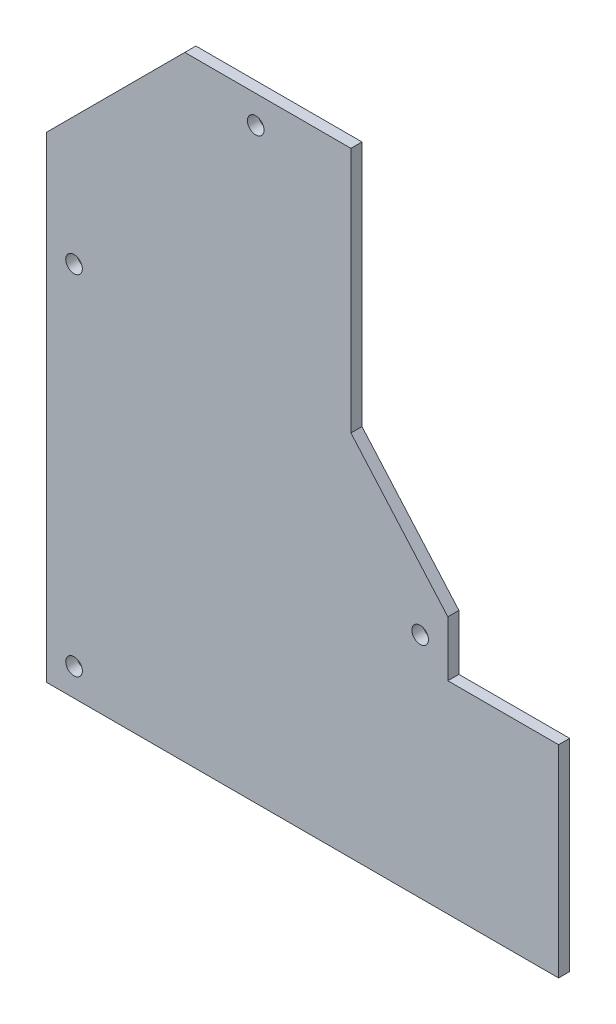
ISO-10303-21;
HEADER;
FILE_DESCRIPTION(('STEP AP214'),'2;1');
FILE_NAME('part.step','',(''),(''),'','','');
FILE_SCHEMA(('AUTOMOTIVE_DESIGN { 1 0 10303 214 1 1 1 1 }'));
ENDSEC;
DATA;
#1=APPLICATION_CONTEXT('core data for automotive mechanical design processes');
#2=APPLICATION_PROTOCOL_DEFINITION('international standard','automotive_design',2000,#1);
#3=PRODUCT_CONTEXT('',#1,'mechanical');
#4=PRODUCT('Part','Part','',(#3));
#5=PRODUCT_RELATED_PRODUCT_CATEGORY('part','',(#4));
#6=PRODUCT_DEFINITION_FORMATION('','',#4);
#7=PRODUCT_DEFINITION_CONTEXT('part definition',#1,'design');
#8=PRODUCT_DEFINITION('design','',#6,#7);
#9=PRODUCT_DEFINITION_SHAPE('','',#8);
#10=(LENGTH_UNIT() NAMED_UNIT(*) SI_UNIT(.MILLI.,.METRE.));
#11=(NAMED_UNIT(*) PLANE_ANGLE_UNIT() SI_UNIT($,.RADIAN.));
#12=(NAMED_UNIT(*) SI_UNIT($,.STERADIAN.) SOLID_ANGLE_UNIT());
#13=UNCERTAINTY_MEASURE_WITH_UNIT(LENGTH_MEASURE(1.E-05),#10,'distance_accuracy_value','');
#14=(GEOMETRIC_REPRESENTATION_CONTEXT(3) GLOBAL_UNCERTAINTY_ASSIGNED_CONTEXT((#13)) GLOBAL_UNIT_ASSIGNED_CONTEXT((#10,
#11,#12)) REPRESENTATION_CONTEXT('',''));
#15=CARTESIAN_POINT('',(0.,0.,0.));
#16=DIRECTION('',(0.,0.,1.));
#17=DIRECTION('',(1.,0.,0.));
#18=AXIS2_PLACEMENT_3D('',#15,#16,#17);
#19=CARTESIAN_POINT('',(-84.9999999999999,97.0000000000001,4.));
#20=DIRECTION('',(1.,0.,0.));
#21=DIRECTION('',(0.,1.,0.));
#22=AXIS2_PLACEMENT_3D('',#19,#20,#21);
#23=PLANE('',#22);
#24=DIRECTION('',(0.,-1.,0.));
#25=VECTOR('',#24,1.);
#26=CARTESIAN_POINT('',(-84.9999999999999,97.0000000000001,0.));
#27=LINE('',#26,#25);
#28=CARTESIAN_POINT('',(-84.9999999999999,97.0000000000001,0.));
#29=VERTEX_POINT('',#28);
#30=CARTESIAN_POINT('',(-84.9999999999999,-74.9999999999997,0.));
#31=VERTEX_POINT('',#30);
#32=EDGE_CURVE('E134',#29,#31,#27,.T.);
#33=ORIENTED_EDGE('',*,*,#32,.T.);
#34=DIRECTION('',(0.,0.,-1.));
#35=VECTOR('',#34,1.);
#36=CARTESIAN_POINT('',(-84.9999999999999,-74.9999999999997,4.));
#37=LINE('',#36,#35);
#38=CARTESIAN_POINT('',(-84.9999999999999,-74.9999999999997,4.));
#39=VERTEX_POINT('',#38);
#40=EDGE_CURVE('E11',#39,#31,#37,.T.);
#41=ORIENTED_EDGE('',*,*,#40,.F.);
#42=DIRECTION('',(0.,-1.,0.));
#43=VECTOR('',#42,1.);
#44=CARTESIAN_POINT('',(-84.9999999999999,97.0000000000001,4.));
#45=LINE('',#44,#43);
#46=CARTESIAN_POINT('',(-84.9999999999999,97.0000000000001,4.));
#47=VERTEX_POINT('',#46);
#48=EDGE_CURVE('E151',#47,#39,#45,.T.);
#49=ORIENTED_EDGE('',*,*,#48,.F.);
#50=DIRECTION('',(0.,0.,-1.));
#51=VECTOR('',#50,1.);
#52=CARTESIAN_POINT('',(-84.9999999999999,97.0000000000001,4.));
#53=LINE('',#52,#51);
#54=EDGE_CURVE('E130',#47,#29,#53,.T.);
#55=ORIENTED_EDGE('',*,*,#54,.T.);
#56=EDGE_LOOP('',(#33,#41,#49,#55));
#57=FACE_BOUND('',#56,.T.);
#58=ADVANCED_FACE('F32',(#57),#23,.F.);
#59=CARTESIAN_POINT('',(-84.9999999999999,-74.9999999999997,4.));
#60=DIRECTION('',(0.,1.,0.));
#61=DIRECTION('',(0.,0.,1.));
#62=AXIS2_PLACEMENT_3D('',#59,#60,#61);
#63=PLANE('',#62);
#64=DIRECTION('',(1.,0.,0.));
#65=VECTOR('',#64,1.);
#66=CARTESIAN_POINT('',(-84.9999999999999,-74.9999999999997,0.));
#67=LINE('',#66,#65);
#68=CARTESIAN_POINT('',(100.,-74.9999999999997,0.));
#69=VERTEX_POINT('',#68);
#70=EDGE_CURVE('E137',#31,#69,#67,.T.);
#71=ORIENTED_EDGE('',*,*,#70,.T.);
#72=DIRECTION('',(0.,0.,-1.));
#73=VECTOR('',#72,1.);
#74=CARTESIAN_POINT('',(100.,-74.9999999999997,4.));
#75=LINE('',#74,#73);
#76=CARTESIAN_POINT('',(100.,-74.9999999999997,4.));
#77=VERTEX_POINT('',#76);
#78=EDGE_CURVE('E40',#77,#69,#75,.T.);
#79=ORIENTED_EDGE('',*,*,#78,.F.);
#80=DIRECTION('',(1.,0.,0.));
#81=VECTOR('',#80,1.);
#82=CARTESIAN_POINT('',(-84.9999999999999,-74.9999999999997,4.));
#83=LINE('',#82,#81);
#84=EDGE_CURVE('E94',#39,#77,#83,.T.);
#85=ORIENTED_EDGE('',*,*,#84,.F.);
#86=ORIENTED_EDGE('',*,*,#40,.T.);
#87=EDGE_LOOP('',(#71,#79,#85,#86));
#88=FACE_BOUND('',#87,.T.);
#89=ADVANCED_FACE('F240',(#88),#63,.F.);
#90=CARTESIAN_POINT('',(100.,-74.9999999999997,4.));
#91=DIRECTION('',(-1.,0.,0.));
#92=DIRECTION('',(0.,0.,1.));
#93=AXIS2_PLACEMENT_3D('',#90,#91,#92);
#94=PLANE('',#93);
#95=DIRECTION('',(0.,1.,0.));
#96=VECTOR('',#95,1.);
#97=CARTESIAN_POINT('',(100.,-74.9999999999997,0.));
#98=LINE('',#97,#96);
#99=CARTESIAN_POINT('',(100.,-2.03181579102166,0.));
#100=VERTEX_POINT('',#99);
#101=EDGE_CURVE('E140',#69,#100,#98,.T.);
#102=ORIENTED_EDGE('',*,*,#101,.T.);
#103=DIRECTION('',(0.,0.,-1.));
#104=VECTOR('',#103,1.);
#105=CARTESIAN_POINT('',(100.,-2.03181579102166,4.));
#106=LINE('',#105,#104);
#107=CARTESIAN_POINT('',(100.,-2.03181579102166,4.));
#108=VERTEX_POINT('',#107);
#109=EDGE_CURVE('E161',#108,#100,#106,.T.);
#110=ORIENTED_EDGE('',*,*,#109,.F.);
#111=DIRECTION('',(0.,1.,0.));
#112=VECTOR('',#111,1.);
#113=CARTESIAN_POINT('',(100.,-74.9999999999997,4.));
#114=LINE('',#113,#112);
#115=EDGE_CURVE('E169',#77,#108,#114,.T.);
#116=ORIENTED_EDGE('',*,*,#115,.F.);
#117=ORIENTED_EDGE('',*,*,#78,.T.);
#118=EDGE_LOOP('',(#102,#110,#116,#117));
#119=FACE_BOUND('',#118,.T.);
#120=ADVANCED_FACE('F167',(#119),#94,.F.);
#121=CARTESIAN_POINT('',(100.,-2.03181579102166,4.));
#122=DIRECTION('',(0.,-1.,0.));
#123=DIRECTION('',(1.,0.,0.));
#124=AXIS2_PLACEMENT_3D('',#121,#122,#123);
#125=PLANE('',#124);
#126=DIRECTION('',(-1.,0.,0.));
#127=VECTOR('',#126,1.);
#128=CARTESIAN_POINT('',(100.,-2.03181579102166,0.));
#129=LINE('',#128,#127);
#130=CARTESIAN_POINT('',(60.,-2.03181579102167,0.));
#131=VERTEX_POINT('',#130);
#132=EDGE_CURVE('E142',#100,#131,#129,.T.);
#133=ORIENTED_EDGE('',*,*,#132,.T.);
#134=DIRECTION('',(0.,0.,-1.));
#135=VECTOR('',#134,1.);
#136=CARTESIAN_POINT('',(60.,-2.03181579102167,4.));
#137=LINE('',#136,#135);
#138=CARTESIAN_POINT('',(60.,-2.03181579102167,4.));
#139=VERTEX_POINT('',#138);
#140=EDGE_CURVE('E158',#139,#131,#137,.T.);
#141=ORIENTED_EDGE('',*,*,#140,.F.);
#142=DIRECTION('',(-1.,0.,0.));
#143=VECTOR('',#142,1.);
#144=CARTESIAN_POINT('',(100.,-2.03181579102166,4.));
#145=LINE('',#144,#143);
#146=EDGE_CURVE('E185',#108,#139,#145,.T.);
#147=ORIENTED_EDGE('',*,*,#146,.F.);
#148=ORIENTED_EDGE('',*,*,#109,.T.);
#149=EDGE_LOOP('',(#133,#141,#147,#148));
#150=FACE_BOUND('',#149,.T.);
#151=ADVANCED_FACE('F178',(#150),#125,.F.);
#152=CARTESIAN_POINT('',(60.,-2.03181579102167,4.));
#153=DIRECTION('',(-1.,0.,0.));
#154=DIRECTION('',(0.,0.,1.));
#155=AXIS2_PLACEMENT_3D('',#152,#153,#154);
#156=PLANE('',#155);
#157=DIRECTION('',(0.,1.,0.));
#158=VECTOR('',#157,1.);
#159=CARTESIAN_POINT('',(60.,-2.03181579102167,0.));
#160=LINE('',#159,#158);
#161=CARTESIAN_POINT('',(60.,17.9681842089783,0.));
#162=VERTEX_POINT('',#161);
#163=EDGE_CURVE('E144',#131,#162,#160,.T.);
#164=ORIENTED_EDGE('',*,*,#163,.T.);
#165=DIRECTION('',(0.,0.,-1.));
#166=VECTOR('',#165,1.);
#167=CARTESIAN_POINT('',(60.,17.9681842089783,4.));
#168=LINE('',#167,#166);
#169=CARTESIAN_POINT('',(60.,17.9681842089783,4.));
#170=VERTEX_POINT('',#169);
#171=EDGE_CURVE('E155',#170,#162,#168,.T.);
#172=ORIENTED_EDGE('',*,*,#171,.F.);
#173=DIRECTION('',(0.,1.,0.));
#174=VECTOR('',#173,1.);
#175=CARTESIAN_POINT('',(60.,-2.03181579102167,4.));
#176=LINE('',#175,#174);
#177=EDGE_CURVE('E184',#139,#170,#176,.T.);
#178=ORIENTED_EDGE('',*,*,#177,.F.);
#179=ORIENTED_EDGE('',*,*,#140,.T.);
#180=EDGE_LOOP('',(#164,#172,#178,#179));
#181=FACE_BOUND('',#180,.T.);
#182=ADVANCED_FACE('F182',(#181),#156,.F.);
#183=CARTESIAN_POINT('',(60.,17.9681842089783,4.));
#184=DIRECTION('',(-0.752576694706878,-0.658504607868518,0.));
#185=DIRECTION('',(0.658504607868518,-0.752576694706878,0.));
#186=AXIS2_PLACEMENT_3D('',#183,#184,#185);
#187=PLANE('',#186);
#188=DIRECTION('',(-0.658504607868518,0.752576694706878,0.));
#189=VECTOR('',#188,1.);
#190=CARTESIAN_POINT('',(60.,17.9681842089783,0.));
#191=LINE('',#190,#189);
#192=CARTESIAN_POINT('',(25.,57.9681842089783,0.));
#193=VERTEX_POINT('',#192);
#194=EDGE_CURVE('E146',#162,#193,#191,.T.);
#195=ORIENTED_EDGE('',*,*,#194,.T.);
#196=DIRECTION('',(0.,0.,-1.));
#197=VECTOR('',#196,1.);
#198=CARTESIAN_POINT('',(25.,57.9681842089783,4.));
#199=LINE('',#198,#197);
#200=CARTESIAN_POINT('',(25.,57.9681842089783,4.));
#201=VERTEX_POINT('',#200);
#202=EDGE_CURVE('E125',#201,#193,#199,.T.);
#203=ORIENTED_EDGE('',*,*,#202,.F.);
#204=DIRECTION('',(-0.658504607868518,0.752576694706878,0.));
#205=VECTOR('',#204,1.);
#206=CARTESIAN_POINT('',(60.,17.9681842089783,4.));
#207=LINE('',#206,#205);
#208=EDGE_CURVE('E116',#170,#201,#207,.T.);
#209=ORIENTED_EDGE('',*,*,#208,.F.);
#210=ORIENTED_EDGE('',*,*,#171,.T.);
#211=EDGE_LOOP('',(#195,#203,#209,#210));
#212=FACE_BOUND('',#211,.T.);
#213=ADVANCED_FACE('F248',(#212),#187,.F.);
#214=CARTESIAN_POINT('',(25.,57.9681842089783,4.));
#215=DIRECTION('',(-1.,0.,0.));
#216=DIRECTION('',(0.,0.,1.));
#217=AXIS2_PLACEMENT_3D('',#214,#215,#216);
#218=PLANE('',#217);
#219=DIRECTION('',(0.,1.,0.));
#220=VECTOR('',#219,1.);
#221=CARTESIAN_POINT('',(25.,57.9681842089783,0.));
#222=LINE('',#221,#220);
#223=CARTESIAN_POINT('',(25.,147.,0.));
#224=VERTEX_POINT('',#223);
#225=EDGE_CURVE('E124',#193,#224,#222,.T.);
#226=ORIENTED_EDGE('',*,*,#225,.T.);
#227=DIRECTION('',(0.,0.,-1.));
#228=VECTOR('',#227,1.);
#229=CARTESIAN_POINT('',(25.,147.,4.));
#230=LINE('',#229,#228);
#231=CARTESIAN_POINT('',(25.,147.,4.));
#232=VERTEX_POINT('',#231);
#233=EDGE_CURVE('E121',#232,#224,#230,.T.);
#234=ORIENTED_EDGE('',*,*,#233,.F.);
#235=DIRECTION('',(0.,1.,0.));
#236=VECTOR('',#235,1.);
#237=CARTESIAN_POINT('',(25.,57.9681842089783,4.));
#238=LINE('',#237,#236);
#239=EDGE_CURVE('E110',#201,#232,#238,.T.);
#240=ORIENTED_EDGE('',*,*,#239,.F.);
#241=ORIENTED_EDGE('',*,*,#202,.T.);
#242=EDGE_LOOP('',(#226,#234,#240,#241));
#243=FACE_BOUND('',#242,.T.);
#244=ADVANCED_FACE('F122',(#243),#218,.F.);
#245=CARTESIAN_POINT('',(25.,147.,4.));
#246=DIRECTION('',(0.,-1.,0.));
#247=DIRECTION('',(0.,0.,-1.));
#248=AXIS2_PLACEMENT_3D('',#245,#246,#247);
#249=PLANE('',#248);
#250=DIRECTION('',(-1.,0.,0.));
#251=VECTOR('',#250,1.);
#252=CARTESIAN_POINT('',(25.,147.,0.));
#253=LINE('',#252,#251);
#254=CARTESIAN_POINT('',(-34.9999999999998,147.,0.));
#255=VERTEX_POINT('',#254);
#256=EDGE_CURVE('E80',#224,#255,#253,.T.);
#257=ORIENTED_EDGE('',*,*,#256,.T.);
#258=DIRECTION('',(0.,0.,-1.));
#259=VECTOR('',#258,1.);
#260=CARTESIAN_POINT('',(-34.9999999999998,147.,4.));
#261=LINE('',#260,#259);
#262=CARTESIAN_POINT('',(-34.9999999999998,147.,4.));
#263=VERTEX_POINT('',#262);
#264=EDGE_CURVE('E126',#263,#255,#261,.T.);
#265=ORIENTED_EDGE('',*,*,#264,.F.);
#266=DIRECTION('',(-1.,0.,0.));
#267=VECTOR('',#266,1.);
#268=CARTESIAN_POINT('',(25.,147.,4.));
#269=LINE('',#268,#267);
#270=EDGE_CURVE('E114',#232,#263,#269,.T.);
#271=ORIENTED_EDGE('',*,*,#270,.F.);
#272=ORIENTED_EDGE('',*,*,#233,.T.);
#273=EDGE_LOOP('',(#257,#265,#271,#272));
#274=FACE_BOUND('',#273,.T.);
#275=ADVANCED_FACE('F128',(#274),#249,.F.);
#276=CARTESIAN_POINT('',(-34.9999999999998,147.,4.));
#277=DIRECTION('',(0.707106781186548,-0.707106781186547,0.));
#278=DIRECTION('',(0.707106781186547,0.707106781186548,0.));
#279=AXIS2_PLACEMENT_3D('',#276,#277,#278);
#280=PLANE('',#279);
#281=DIRECTION('',(-0.707106781186547,-0.707106781186548,0.));
#282=VECTOR('',#281,1.);
#283=CARTESIAN_POINT('',(-34.9999999999998,147.,0.));
#284=LINE('',#283,#282);
#285=EDGE_CURVE('E86',#255,#29,#284,.T.);
#286=ORIENTED_EDGE('',*,*,#285,.T.);
#287=ORIENTED_EDGE('',*,*,#54,.F.);
#288=DIRECTION('',(-0.707106781186547,-0.707106781186548,0.));
#289=VECTOR('',#288,1.);
#290=CARTESIAN_POINT('',(-34.9999999999998,147.,4.));
#291=LINE('',#290,#289);
#292=EDGE_CURVE('E48',#263,#47,#291,.T.);
#293=ORIENTED_EDGE('',*,*,#292,.F.);
#294=ORIENTED_EDGE('',*,*,#264,.T.);
#295=EDGE_LOOP('',(#286,#287,#293,#294));
#296=FACE_BOUND('',#295,.T.);
#297=ADVANCED_FACE('F293',(#296),#280,.F.);
#298=CARTESIAN_POINT('',(-84.9999999999999,-74.9999999999997,4.));
#299=DIRECTION('',(0.,0.,1.));
#300=DIRECTION('',(1.,0.,0.));
#301=AXIS2_PLACEMENT_3D('',#298,#299,#300);
#302=PLANE('',#301);
#303=CARTESIAN_POINT('',(-74.9999999999999,60.7867965644037,4.));
#304=DIRECTION('',(0.,0.,1.));
#305=DIRECTION('',(1.,0.,0.));
#306=AXIS2_PLACEMENT_3D('',#303,#304,#305);
#307=CIRCLE('',#306,3.00000000000001);
#308=CARTESIAN_POINT('',(-71.9999999999999,60.7867965644037,4.));
#309=VERTEX_POINT('',#308);
#310=EDGE_CURVE('E209',#309,#309,#307,.T.);
#311=ORIENTED_EDGE('',*,*,#310,.F.);
#312=EDGE_LOOP('',(#311));
#313=FACE_BOUND('',#312,.T.);
#314=CARTESIAN_POINT('',(-9.3933982822017,137.,4.));
#315=DIRECTION('',(0.,0.,1.));
#316=DIRECTION('',(1.,0.,0.));
#317=AXIS2_PLACEMENT_3D('',#314,#315,#316);
#318=CIRCLE('',#317,3.);
#319=CARTESIAN_POINT('',(-6.3933982822017,137.,4.));
#320=VERTEX_POINT('',#319);
#321=EDGE_CURVE('E203',#320,#320,#318,.T.);
#322=ORIENTED_EDGE('',*,*,#321,.F.);
#323=EDGE_LOOP('',(#322));
#324=FACE_BOUND('',#323,.T.);
#325=CARTESIAN_POINT('',(50.,7.33215746740409,4.));
#326=DIRECTION('',(0.,0.,1.));
#327=DIRECTION('',(1.,0.,0.));
#328=AXIS2_PLACEMENT_3D('',#325,#326,#327);
#329=CIRCLE('',#328,3.);
#330=CARTESIAN_POINT('',(53.,7.33215746740409,4.));
#331=VERTEX_POINT('',#330);
#332=EDGE_CURVE('E197',#331,#331,#329,.T.);
#333=ORIENTED_EDGE('',*,*,#332,.F.);
#334=EDGE_LOOP('',(#333));
#335=FACE_BOUND('',#334,.T.);
#336=CARTESIAN_POINT('',(-74.9999999999999,-64.9999999999998,4.));
#337=DIRECTION('',(0.,0.,1.));
#338=DIRECTION('',(1.,0.,0.));
#339=AXIS2_PLACEMENT_3D('',#336,#337,#338);
#340=CIRCLE('',#339,3.00000000000001);
#341=CARTESIAN_POINT('',(-71.9999999999999,-64.9999999999998,4.));
#342=VERTEX_POINT('',#341);
#343=EDGE_CURVE('E138',#342,#342,#340,.T.);
#344=ORIENTED_EDGE('',*,*,#343,.F.);
#345=EDGE_LOOP('',(#344));
#346=FACE_BOUND('',#345,.T.);
#347=ORIENTED_EDGE('',*,*,#48,.T.);
#348=ORIENTED_EDGE('',*,*,#84,.T.);
#349=ORIENTED_EDGE('',*,*,#115,.T.);
#350=ORIENTED_EDGE('',*,*,#146,.T.);
#351=ORIENTED_EDGE('',*,*,#177,.T.);
#352=ORIENTED_EDGE('',*,*,#208,.T.);
#353=ORIENTED_EDGE('',*,*,#239,.T.);
#354=ORIENTED_EDGE('',*,*,#270,.T.);
#355=ORIENTED_EDGE('',*,*,#292,.T.);
#356=EDGE_LOOP('',(#347,#348,#349,#350,#351,#352,#353,#354,#355));
#357=FACE_BOUND('',#356,.T.);
#358=ADVANCED_FACE('F112',(#313,#324,#335,#346,#357),#302,.T.);
#359=CARTESIAN_POINT('',(-84.9999999999999,-74.9999999999997,0.));
#360=DIRECTION('',(0.,0.,1.));
#361=DIRECTION('',(1.,0.,0.));
#362=AXIS2_PLACEMENT_3D('',#359,#360,#361);
#363=PLANE('',#362);
#364=CARTESIAN_POINT('',(-74.9999999999999,60.7867965644037,0.));
#365=DIRECTION('',(0.,0.,-1.));
#366=DIRECTION('',(-1.,0.,0.));
#367=AXIS2_PLACEMENT_3D('',#364,#365,#366);
#368=CIRCLE('',#367,3.00000000000001);
#369=CARTESIAN_POINT('',(-77.9999999999999,60.7867965644037,0.));
#370=VERTEX_POINT('',#369);
#371=EDGE_CURVE('E212',#370,#370,#368,.T.);
#372=ORIENTED_EDGE('',*,*,#371,.F.);
#373=EDGE_LOOP('',(#372));
#374=FACE_BOUND('',#373,.T.);
#375=CARTESIAN_POINT('',(-9.3933982822017,137.,0.));
#376=DIRECTION('',(0.,0.,-1.));
#377=DIRECTION('',(-1.,0.,0.));
#378=AXIS2_PLACEMENT_3D('',#375,#376,#377);
#379=CIRCLE('',#378,3.);
#380=CARTESIAN_POINT('',(-12.3933982822017,137.,0.));
#381=VERTEX_POINT('',#380);
#382=EDGE_CURVE('E206',#381,#381,#379,.T.);
#383=ORIENTED_EDGE('',*,*,#382,.F.);
#384=EDGE_LOOP('',(#383));
#385=FACE_BOUND('',#384,.T.);
#386=CARTESIAN_POINT('',(50.,7.33215746740409,0.));
#387=DIRECTION('',(0.,0.,-1.));
#388=DIRECTION('',(-1.,0.,0.));
#389=AXIS2_PLACEMENT_3D('',#386,#387,#388);
#390=CIRCLE('',#389,3.);
#391=CARTESIAN_POINT('',(47.,7.33215746740409,0.));
#392=VERTEX_POINT('',#391);
#393=EDGE_CURVE('E200',#392,#392,#390,.T.);
#394=ORIENTED_EDGE('',*,*,#393,.F.);
#395=EDGE_LOOP('',(#394));
#396=FACE_BOUND('',#395,.T.);
#397=CARTESIAN_POINT('',(-74.9999999999999,-64.9999999999998,0.));
#398=DIRECTION('',(0.,0.,-1.));
#399=DIRECTION('',(-1.,0.,0.));
#400=AXIS2_PLACEMENT_3D('',#397,#398,#399);
#401=CIRCLE('',#400,3.00000000000001);
#402=CARTESIAN_POINT('',(-77.9999999999999,-64.9999999999998,0.));
#403=VERTEX_POINT('',#402);
#404=EDGE_CURVE('E194',#403,#403,#401,.T.);
#405=ORIENTED_EDGE('',*,*,#404,.F.);
#406=EDGE_LOOP('',(#405));
#407=FACE_BOUND('',#406,.T.);
#408=ORIENTED_EDGE('',*,*,#32,.F.);
#409=ORIENTED_EDGE('',*,*,#285,.F.);
#410=ORIENTED_EDGE('',*,*,#256,.F.);
#411=ORIENTED_EDGE('',*,*,#225,.F.);
#412=ORIENTED_EDGE('',*,*,#194,.F.);
#413=ORIENTED_EDGE('',*,*,#163,.F.);
#414=ORIENTED_EDGE('',*,*,#132,.F.);
#415=ORIENTED_EDGE('',*,*,#101,.F.);
#416=ORIENTED_EDGE('',*,*,#70,.F.);
#417=EDGE_LOOP('',(#408,#409,#410,#411,#412,#413,#414,#415,#416));
#418=FACE_BOUND('',#417,.T.);
#419=ADVANCED_FACE('F173',(#374,#385,#396,#407,#418),#363,.F.);
#420=CARTESIAN_POINT('',(-74.9999999999999,-64.9999999999998,10.));
#421=DIRECTION('',(0.,0.,-1.));
#422=DIRECTION('',(-1.,0.,0.));
#423=AXIS2_PLACEMENT_3D('',#420,#421,#422);
#424=CYLINDRICAL_SURFACE('',#423,3.00000000000001);
#425=ORIENTED_EDGE('',*,*,#343,.T.);
#426=EDGE_LOOP('',(#425));
#427=FACE_BOUND('',#426,.T.);
#428=ORIENTED_EDGE('',*,*,#404,.T.);
#429=EDGE_LOOP('',(#428));
#430=FACE_BOUND('',#429,.T.);
#431=ADVANCED_FACE('F220',(#427,#430),#424,.F.);
#432=CARTESIAN_POINT('',(50.,7.33215746740409,10.));
#433=DIRECTION('',(0.,0.,-1.));
#434=DIRECTION('',(-1.,0.,0.));
#435=AXIS2_PLACEMENT_3D('',#432,#433,#434);
#436=CYLINDRICAL_SURFACE('',#435,3.);
#437=ORIENTED_EDGE('',*,*,#332,.T.);
#438=EDGE_LOOP('',(#437));
#439=FACE_BOUND('',#438,.T.);
#440=ORIENTED_EDGE('',*,*,#393,.T.);
#441=EDGE_LOOP('',(#440));
#442=FACE_BOUND('',#441,.T.);
#443=ADVANCED_FACE('F229',(#439,#442),#436,.F.);
#444=CARTESIAN_POINT('',(-9.3933982822017,137.,10.));
#445=DIRECTION('',(0.,0.,-1.));
#446=DIRECTION('',(-1.,0.,0.));
#447=AXIS2_PLACEMENT_3D('',#444,#445,#446);
#448=CYLINDRICAL_SURFACE('',#447,3.);
#449=ORIENTED_EDGE('',*,*,#321,.T.);
#450=EDGE_LOOP('',(#449));
#451=FACE_BOUND('',#450,.T.);
#452=ORIENTED_EDGE('',*,*,#382,.T.);
#453=EDGE_LOOP('',(#452));
#454=FACE_BOUND('',#453,.T.);
#455=ADVANCED_FACE('F235',(#451,#454),#448,.F.);
#456=CARTESIAN_POINT('',(-74.9999999999999,60.7867965644037,10.));
#457=DIRECTION('',(0.,0.,-1.));
#458=DIRECTION('',(-1.,0.,0.));
#459=AXIS2_PLACEMENT_3D('',#456,#457,#458);
#460=CYLINDRICAL_SURFACE('',#459,3.00000000000001);
#461=ORIENTED_EDGE('',*,*,#310,.T.);
#462=EDGE_LOOP('',(#461));
#463=FACE_BOUND('',#462,.T.);
#464=ORIENTED_EDGE('',*,*,#371,.T.);
#465=EDGE_LOOP('',(#464));
#466=FACE_BOUND('',#465,.T.);
#467=ADVANCED_FACE('F216',(#463,#466),#460,.F.);
#468=CLOSED_SHELL('',(#58,#89,#120,#151,#182,#213,#244,#275,#297,#358,#419,#431,#443,#455,#467));
#469=MANIFOLD_SOLID_BREP('B2',#468);
#470=ADVANCED_BREP_SHAPE_REPRESENTATION('',(#18,#469),#14);
#471=SHAPE_DEFINITION_REPRESENTATION(#9,#470);
ENDSEC;
END-ISO-10303-21;
